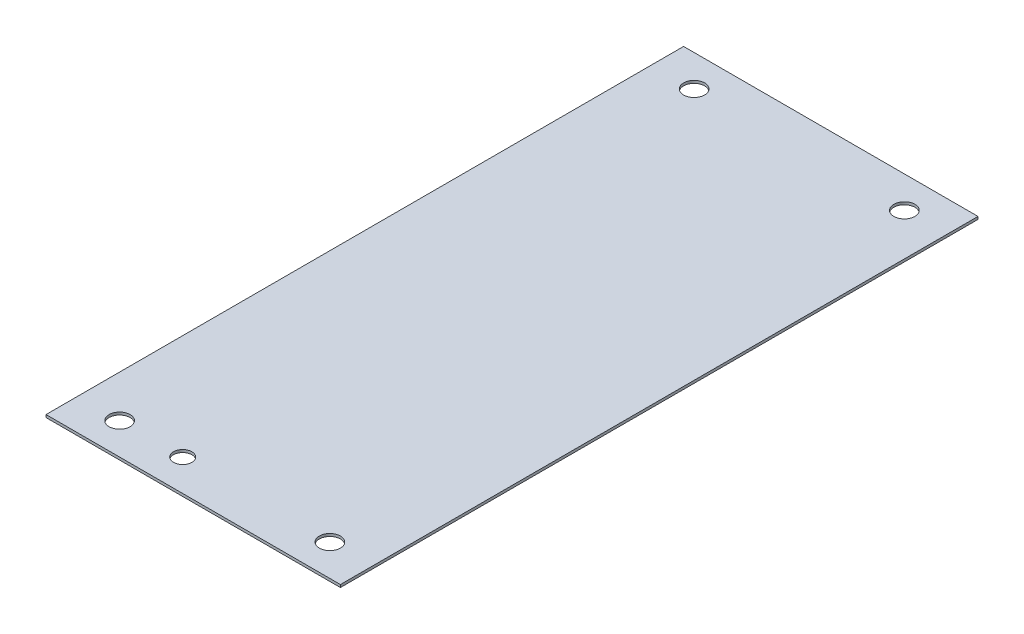
ISO-10303-21;
HEADER;
FILE_DESCRIPTION(('STEP AP214'),'2;1');
FILE_NAME('part.step','',(''),(''),'','','');
FILE_SCHEMA(('AUTOMOTIVE_DESIGN { 1 0 10303 214 1 1 1 1 }'));
ENDSEC;
DATA;
#1=APPLICATION_CONTEXT('core data for automotive mechanical design processes');
#2=APPLICATION_PROTOCOL_DEFINITION('international standard','automotive_design',2000,#1);
#3=PRODUCT_CONTEXT('',#1,'mechanical');
#4=PRODUCT('Part','Part','',(#3));
#5=PRODUCT_RELATED_PRODUCT_CATEGORY('part','',(#4));
#6=PRODUCT_DEFINITION_FORMATION('','',#4);
#7=PRODUCT_DEFINITION_CONTEXT('part definition',#1,'design');
#8=PRODUCT_DEFINITION('design','',#6,#7);
#9=PRODUCT_DEFINITION_SHAPE('','',#8);
#10=(LENGTH_UNIT() NAMED_UNIT(*) SI_UNIT(.MILLI.,.METRE.));
#11=(NAMED_UNIT(*) PLANE_ANGLE_UNIT() SI_UNIT($,.RADIAN.));
#12=(NAMED_UNIT(*) SI_UNIT($,.STERADIAN.) SOLID_ANGLE_UNIT());
#13=UNCERTAINTY_MEASURE_WITH_UNIT(LENGTH_MEASURE(1.E-05),#10,'distance_accuracy_value','');
#14=(GEOMETRIC_REPRESENTATION_CONTEXT(3) GLOBAL_UNCERTAINTY_ASSIGNED_CONTEXT((#13)) GLOBAL_UNIT_ASSIGNED_CONTEXT((#10,
#11,#12)) REPRESENTATION_CONTEXT('',''));
#15=CARTESIAN_POINT('',(0.,0.,0.));
#16=DIRECTION('',(0.,0.,1.));
#17=DIRECTION('',(1.,0.,0.));
#18=AXIS2_PLACEMENT_3D('',#15,#16,#17);
#19=CARTESIAN_POINT('',(0.,3.175,0.));
#20=DIRECTION('',(1.,0.,0.));
#21=DIRECTION('',(0.,0.,-1.));
#22=AXIS2_PLACEMENT_3D('',#19,#20,#21);
#23=PLANE('',#22);
#24=DIRECTION('',(0.,0.,1.));
#25=VECTOR('',#24,1.);
#26=CARTESIAN_POINT('',(0.,0.,0.));
#27=LINE('',#26,#25);
#28=CARTESIAN_POINT('',(0.,0.,-770.128));
#29=VERTEX_POINT('',#28);
#30=CARTESIAN_POINT('',(0.,0.,0.));
#31=VERTEX_POINT('',#30);
#32=EDGE_CURVE('E99',#29,#31,#27,.T.);
#33=ORIENTED_EDGE('',*,*,#32,.T.);
#34=DIRECTION('',(0.,-1.,0.));
#35=VECTOR('',#34,1.);
#36=CARTESIAN_POINT('',(0.,3.175,0.));
#37=LINE('',#36,#35);
#38=CARTESIAN_POINT('',(0.,3.175,0.));
#39=VERTEX_POINT('',#38);
#40=EDGE_CURVE('E11',#39,#31,#37,.T.);
#41=ORIENTED_EDGE('',*,*,#40,.F.);
#42=DIRECTION('',(0.,0.,1.));
#43=VECTOR('',#42,1.);
#44=CARTESIAN_POINT('',(0.,3.175,0.));
#45=LINE('',#44,#43);
#46=CARTESIAN_POINT('',(0.,3.175,-770.128));
#47=VERTEX_POINT('',#46);
#48=EDGE_CURVE('E86',#47,#39,#45,.T.);
#49=ORIENTED_EDGE('',*,*,#48,.F.);
#50=DIRECTION('',(0.,-1.,0.));
#51=VECTOR('',#50,1.);
#52=CARTESIAN_POINT('',(0.,3.175,-770.128));
#53=LINE('',#52,#51);
#54=EDGE_CURVE('E95',#47,#29,#53,.T.);
#55=ORIENTED_EDGE('',*,*,#54,.T.);
#56=EDGE_LOOP('',(#33,#41,#49,#55));
#57=FACE_BOUND('',#56,.T.);
#58=ADVANCED_FACE('F34',(#57),#23,.F.);
#59=CARTESIAN_POINT('',(0.,3.175,0.));
#60=DIRECTION('',(0.,0.,-1.));
#61=DIRECTION('',(-1.,0.,0.));
#62=AXIS2_PLACEMENT_3D('',#59,#60,#61);
#63=PLANE('',#62);
#64=DIRECTION('',(1.,0.,0.));
#65=VECTOR('',#64,1.);
#66=CARTESIAN_POINT('',(0.,0.,0.));
#67=LINE('',#66,#65);
#68=CARTESIAN_POINT('',(355.6,0.,0.));
#69=VERTEX_POINT('',#68);
#70=EDGE_CURVE('E90',#31,#69,#67,.T.);
#71=ORIENTED_EDGE('',*,*,#70,.T.);
#72=DIRECTION('',(0.,-1.,0.));
#73=VECTOR('',#72,1.);
#74=CARTESIAN_POINT('',(355.6,3.175,0.));
#75=LINE('',#74,#73);
#76=CARTESIAN_POINT('',(355.6,3.175,0.));
#77=VERTEX_POINT('',#76);
#78=EDGE_CURVE('E43',#77,#69,#75,.T.);
#79=ORIENTED_EDGE('',*,*,#78,.F.);
#80=DIRECTION('',(1.,0.,0.));
#81=VECTOR('',#80,1.);
#82=CARTESIAN_POINT('',(0.,3.175,0.));
#83=LINE('',#82,#81);
#84=EDGE_CURVE('E81',#39,#77,#83,.T.);
#85=ORIENTED_EDGE('',*,*,#84,.F.);
#86=ORIENTED_EDGE('',*,*,#40,.T.);
#87=EDGE_LOOP('',(#71,#79,#85,#86));
#88=FACE_BOUND('',#87,.T.);
#89=ADVANCED_FACE('F89',(#88),#63,.F.);
#90=CARTESIAN_POINT('',(355.6,3.175,0.));
#91=DIRECTION('',(-1.,0.,0.));
#92=DIRECTION('',(0.,0.,1.));
#93=AXIS2_PLACEMENT_3D('',#90,#91,#92);
#94=PLANE('',#93);
#95=DIRECTION('',(0.,0.,-1.));
#96=VECTOR('',#95,1.);
#97=CARTESIAN_POINT('',(355.6,0.,0.));
#98=LINE('',#97,#96);
#99=CARTESIAN_POINT('',(355.6,0.,-770.128));
#100=VERTEX_POINT('',#99);
#101=EDGE_CURVE('E68',#69,#100,#98,.T.);
#102=ORIENTED_EDGE('',*,*,#101,.T.);
#103=DIRECTION('',(0.,-1.,0.));
#104=VECTOR('',#103,1.);
#105=CARTESIAN_POINT('',(355.6,3.175,-770.128));
#106=LINE('',#105,#104);
#107=CARTESIAN_POINT('',(355.6,3.175,-770.128));
#108=VERTEX_POINT('',#107);
#109=EDGE_CURVE('E91',#108,#100,#106,.T.);
#110=ORIENTED_EDGE('',*,*,#109,.F.);
#111=DIRECTION('',(0.,0.,-1.));
#112=VECTOR('',#111,1.);
#113=CARTESIAN_POINT('',(355.6,3.175,0.));
#114=LINE('',#113,#112);
#115=EDGE_CURVE('E84',#77,#108,#114,.T.);
#116=ORIENTED_EDGE('',*,*,#115,.F.);
#117=ORIENTED_EDGE('',*,*,#78,.T.);
#118=EDGE_LOOP('',(#102,#110,#116,#117));
#119=FACE_BOUND('',#118,.T.);
#120=ADVANCED_FACE('F93',(#119),#94,.F.);
#121=CARTESIAN_POINT('',(0.,3.175,-770.128));
#122=DIRECTION('',(0.,0.,1.));
#123=DIRECTION('',(1.,0.,0.));
#124=AXIS2_PLACEMENT_3D('',#121,#122,#123);
#125=PLANE('',#124);
#126=DIRECTION('',(-1.,0.,0.));
#127=VECTOR('',#126,1.);
#128=CARTESIAN_POINT('',(0.,0.,-770.128));
#129=LINE('',#128,#127);
#130=EDGE_CURVE('E74',#100,#29,#129,.T.);
#131=ORIENTED_EDGE('',*,*,#130,.T.);
#132=ORIENTED_EDGE('',*,*,#54,.F.);
#133=DIRECTION('',(-1.,0.,0.));
#134=VECTOR('',#133,1.);
#135=CARTESIAN_POINT('',(0.,3.175,-770.128));
#136=LINE('',#135,#134);
#137=EDGE_CURVE('E51',#108,#47,#136,.T.);
#138=ORIENTED_EDGE('',*,*,#137,.F.);
#139=ORIENTED_EDGE('',*,*,#109,.T.);
#140=EDGE_LOOP('',(#131,#132,#138,#139));
#141=FACE_BOUND('',#140,.T.);
#142=ADVANCED_FACE('F107',(#141),#125,.F.);
#143=CARTESIAN_POINT('',(0.,3.175,-770.128));
#144=DIRECTION('',(0.,-1.,0.));
#145=DIRECTION('',(0.,0.,-1.));
#146=AXIS2_PLACEMENT_3D('',#143,#144,#145);
#147=PLANE('',#146);
#148=CARTESIAN_POINT('',(127.,3.175,-38.1));
#149=DIRECTION('',(0.,1.,0.));
#150=DIRECTION('',(0.,0.,1.));
#151=AXIS2_PLACEMENT_3D('',#148,#149,#150);
#152=CIRCLE('',#151,11.1125);
#153=CARTESIAN_POINT('',(127.,3.175,-26.9875));
#154=VERTEX_POINT('',#153);
#155=EDGE_CURVE('E134',#154,#154,#152,.T.);
#156=ORIENTED_EDGE('',*,*,#155,.F.);
#157=EDGE_LOOP('',(#156));
#158=FACE_BOUND('',#157,.T.);
#159=CARTESIAN_POINT('',(50.8,3.175,-38.1));
#160=DIRECTION('',(0.,1.,0.));
#161=DIRECTION('',(0.,0.,1.));
#162=AXIS2_PLACEMENT_3D('',#159,#160,#161);
#163=CIRCLE('',#162,12.7);
#164=CARTESIAN_POINT('',(50.8,3.175,-25.4));
#165=VERTEX_POINT('',#164);
#166=EDGE_CURVE('E130',#165,#165,#163,.T.);
#167=ORIENTED_EDGE('',*,*,#166,.F.);
#168=EDGE_LOOP('',(#167));
#169=FACE_BOUND('',#168,.T.);
#170=CARTESIAN_POINT('',(50.7999999999999,3.175,-732.028));
#171=DIRECTION('',(0.,1.,0.));
#172=DIRECTION('',(0.,0.,1.));
#173=AXIS2_PLACEMENT_3D('',#170,#171,#172);
#174=CIRCLE('',#173,12.7);
#175=CARTESIAN_POINT('',(50.7999999999999,3.175,-719.328));
#176=VERTEX_POINT('',#175);
#177=EDGE_CURVE('E124',#176,#176,#174,.T.);
#178=ORIENTED_EDGE('',*,*,#177,.F.);
#179=EDGE_LOOP('',(#178));
#180=FACE_BOUND('',#179,.T.);
#181=CARTESIAN_POINT('',(304.8,3.175,-732.028));
#182=DIRECTION('',(0.,1.,0.));
#183=DIRECTION('',(0.,0.,1.));
#184=AXIS2_PLACEMENT_3D('',#181,#182,#183);
#185=CIRCLE('',#184,12.7);
#186=CARTESIAN_POINT('',(304.8,3.175,-719.328));
#187=VERTEX_POINT('',#186);
#188=EDGE_CURVE('E118',#187,#187,#185,.T.);
#189=ORIENTED_EDGE('',*,*,#188,.F.);
#190=EDGE_LOOP('',(#189));
#191=FACE_BOUND('',#190,.T.);
#192=CARTESIAN_POINT('',(304.8,3.175,-38.1000000000001));
#193=DIRECTION('',(0.,1.,0.));
#194=DIRECTION('',(0.,0.,1.));
#195=AXIS2_PLACEMENT_3D('',#192,#193,#194);
#196=CIRCLE('',#195,12.7);
#197=CARTESIAN_POINT('',(304.8,3.175,-25.4000000000001));
#198=VERTEX_POINT('',#197);
#199=EDGE_CURVE('E115',#198,#198,#196,.T.);
#200=ORIENTED_EDGE('',*,*,#199,.F.);
#201=EDGE_LOOP('',(#200));
#202=FACE_BOUND('',#201,.T.);
#203=ORIENTED_EDGE('',*,*,#48,.T.);
#204=ORIENTED_EDGE('',*,*,#84,.T.);
#205=ORIENTED_EDGE('',*,*,#115,.T.);
#206=ORIENTED_EDGE('',*,*,#137,.T.);
#207=EDGE_LOOP('',(#203,#204,#205,#206));
#208=FACE_BOUND('',#207,.T.);
#209=ADVANCED_FACE('F82',(#158,#169,#180,#191,#202,#208),#147,.F.);
#210=CARTESIAN_POINT('',(0.,0.,-770.128));
#211=DIRECTION('',(0.,-1.,0.));
#212=DIRECTION('',(0.,0.,-1.));
#213=AXIS2_PLACEMENT_3D('',#210,#211,#212);
#214=PLANE('',#213);
#215=CARTESIAN_POINT('',(127.,0.,-38.1));
#216=DIRECTION('',(0.,1.,0.));
#217=DIRECTION('',(0.,0.,1.));
#218=AXIS2_PLACEMENT_3D('',#215,#216,#217);
#219=CIRCLE('',#218,11.1125);
#220=CARTESIAN_POINT('',(127.,0.,-26.9875));
#221=VERTEX_POINT('',#220);
#222=EDGE_CURVE('E133',#221,#221,#219,.T.);
#223=ORIENTED_EDGE('',*,*,#222,.T.);
#224=EDGE_LOOP('',(#223));
#225=FACE_BOUND('',#224,.T.);
#226=CARTESIAN_POINT('',(50.8,0.,-38.1));
#227=DIRECTION('',(0.,-1.,0.));
#228=DIRECTION('',(0.,0.,-1.));
#229=AXIS2_PLACEMENT_3D('',#226,#227,#228);
#230=CIRCLE('',#229,12.7);
#231=CARTESIAN_POINT('',(50.8,0.,-50.8));
#232=VERTEX_POINT('',#231);
#233=EDGE_CURVE('E127',#232,#232,#230,.T.);
#234=ORIENTED_EDGE('',*,*,#233,.F.);
#235=EDGE_LOOP('',(#234));
#236=FACE_BOUND('',#235,.T.);
#237=CARTESIAN_POINT('',(50.7999999999999,0.,-732.028));
#238=DIRECTION('',(0.,-1.,0.));
#239=DIRECTION('',(0.,0.,-1.));
#240=AXIS2_PLACEMENT_3D('',#237,#238,#239);
#241=CIRCLE('',#240,12.7);
#242=CARTESIAN_POINT('',(50.7999999999999,0.,-744.728));
#243=VERTEX_POINT('',#242);
#244=EDGE_CURVE('E121',#243,#243,#241,.T.);
#245=ORIENTED_EDGE('',*,*,#244,.F.);
#246=EDGE_LOOP('',(#245));
#247=FACE_BOUND('',#246,.T.);
#248=CARTESIAN_POINT('',(304.8,0.,-732.028));
#249=DIRECTION('',(0.,-1.,0.));
#250=DIRECTION('',(0.,0.,-1.));
#251=AXIS2_PLACEMENT_3D('',#248,#249,#250);
#252=CIRCLE('',#251,12.7);
#253=CARTESIAN_POINT('',(304.8,0.,-744.728));
#254=VERTEX_POINT('',#253);
#255=EDGE_CURVE('E37',#254,#254,#252,.T.);
#256=ORIENTED_EDGE('',*,*,#255,.F.);
#257=EDGE_LOOP('',(#256));
#258=FACE_BOUND('',#257,.T.);
#259=CARTESIAN_POINT('',(304.8,0.,-38.1000000000001));
#260=DIRECTION('',(0.,-1.,0.));
#261=DIRECTION('',(0.,0.,-1.));
#262=AXIS2_PLACEMENT_3D('',#259,#260,#261);
#263=CIRCLE('',#262,12.7);
#264=CARTESIAN_POINT('',(304.8,0.,-50.8));
#265=VERTEX_POINT('',#264);
#266=EDGE_CURVE('E102',#265,#265,#263,.T.);
#267=ORIENTED_EDGE('',*,*,#266,.F.);
#268=EDGE_LOOP('',(#267));
#269=FACE_BOUND('',#268,.T.);
#270=ORIENTED_EDGE('',*,*,#32,.F.);
#271=ORIENTED_EDGE('',*,*,#130,.F.);
#272=ORIENTED_EDGE('',*,*,#101,.F.);
#273=ORIENTED_EDGE('',*,*,#70,.F.);
#274=EDGE_LOOP('',(#270,#271,#272,#273));
#275=FACE_BOUND('',#274,.T.);
#276=ADVANCED_FACE('F110',(#225,#236,#247,#258,#269,#275),#214,.T.);
#277=CARTESIAN_POINT('',(304.8,3.175,-38.1000000000001));
#278=DIRECTION('',(0.,1.,0.));
#279=DIRECTION('',(0.,0.,1.));
#280=AXIS2_PLACEMENT_3D('',#277,#278,#279);
#281=CYLINDRICAL_SURFACE('',#280,12.7);
#282=ORIENTED_EDGE('',*,*,#266,.T.);
#283=EDGE_LOOP('',(#282));
#284=FACE_BOUND('',#283,.T.);
#285=ORIENTED_EDGE('',*,*,#199,.T.);
#286=EDGE_LOOP('',(#285));
#287=FACE_BOUND('',#286,.T.);
#288=ADVANCED_FACE('F160',(#284,#287),#281,.F.);
#289=CARTESIAN_POINT('',(304.8,3.175,-732.028));
#290=DIRECTION('',(0.,1.,0.));
#291=DIRECTION('',(0.,0.,1.));
#292=AXIS2_PLACEMENT_3D('',#289,#290,#291);
#293=CYLINDRICAL_SURFACE('',#292,12.7);
#294=ORIENTED_EDGE('',*,*,#255,.T.);
#295=EDGE_LOOP('',(#294));
#296=FACE_BOUND('',#295,.T.);
#297=ORIENTED_EDGE('',*,*,#188,.T.);
#298=EDGE_LOOP('',(#297));
#299=FACE_BOUND('',#298,.T.);
#300=ADVANCED_FACE('F162',(#296,#299),#293,.F.);
#301=CARTESIAN_POINT('',(50.7999999999999,3.175,-732.028));
#302=DIRECTION('',(0.,1.,0.));
#303=DIRECTION('',(0.,0.,1.));
#304=AXIS2_PLACEMENT_3D('',#301,#302,#303);
#305=CYLINDRICAL_SURFACE('',#304,12.7);
#306=ORIENTED_EDGE('',*,*,#244,.T.);
#307=EDGE_LOOP('',(#306));
#308=FACE_BOUND('',#307,.T.);
#309=ORIENTED_EDGE('',*,*,#177,.T.);
#310=EDGE_LOOP('',(#309));
#311=FACE_BOUND('',#310,.T.);
#312=ADVANCED_FACE('F169',(#308,#311),#305,.F.);
#313=CARTESIAN_POINT('',(50.8,3.175,-38.1));
#314=DIRECTION('',(0.,1.,0.));
#315=DIRECTION('',(0.,0.,1.));
#316=AXIS2_PLACEMENT_3D('',#313,#314,#315);
#317=CYLINDRICAL_SURFACE('',#316,12.7);
#318=ORIENTED_EDGE('',*,*,#233,.T.);
#319=EDGE_LOOP('',(#318));
#320=FACE_BOUND('',#319,.T.);
#321=ORIENTED_EDGE('',*,*,#166,.T.);
#322=EDGE_LOOP('',(#321));
#323=FACE_BOUND('',#322,.T.);
#324=ADVANCED_FACE('F145',(#320,#323),#317,.F.);
#325=CARTESIAN_POINT('',(127.,0.,-38.1));
#326=DIRECTION('',(0.,1.,0.));
#327=DIRECTION('',(0.,0.,1.));
#328=AXIS2_PLACEMENT_3D('',#325,#326,#327);
#329=CYLINDRICAL_SURFACE('',#328,11.1125);
#330=ORIENTED_EDGE('',*,*,#222,.F.);
#331=EDGE_LOOP('',(#330));
#332=FACE_BOUND('',#331,.T.);
#333=ORIENTED_EDGE('',*,*,#155,.T.);
#334=EDGE_LOOP('',(#333));
#335=FACE_BOUND('',#334,.T.);
#336=ADVANCED_FACE('F142',(#332,#335),#329,.F.);
#337=CLOSED_SHELL('',(#58,#89,#120,#142,#209,#276,#288,#300,#312,#324,#336));
#338=MANIFOLD_SOLID_BREP('B2',#337);
#339=ADVANCED_BREP_SHAPE_REPRESENTATION('',(#18,#338),#14);
#340=SHAPE_DEFINITION_REPRESENTATION(#9,#339);
ENDSEC;
END-ISO-10303-21;
